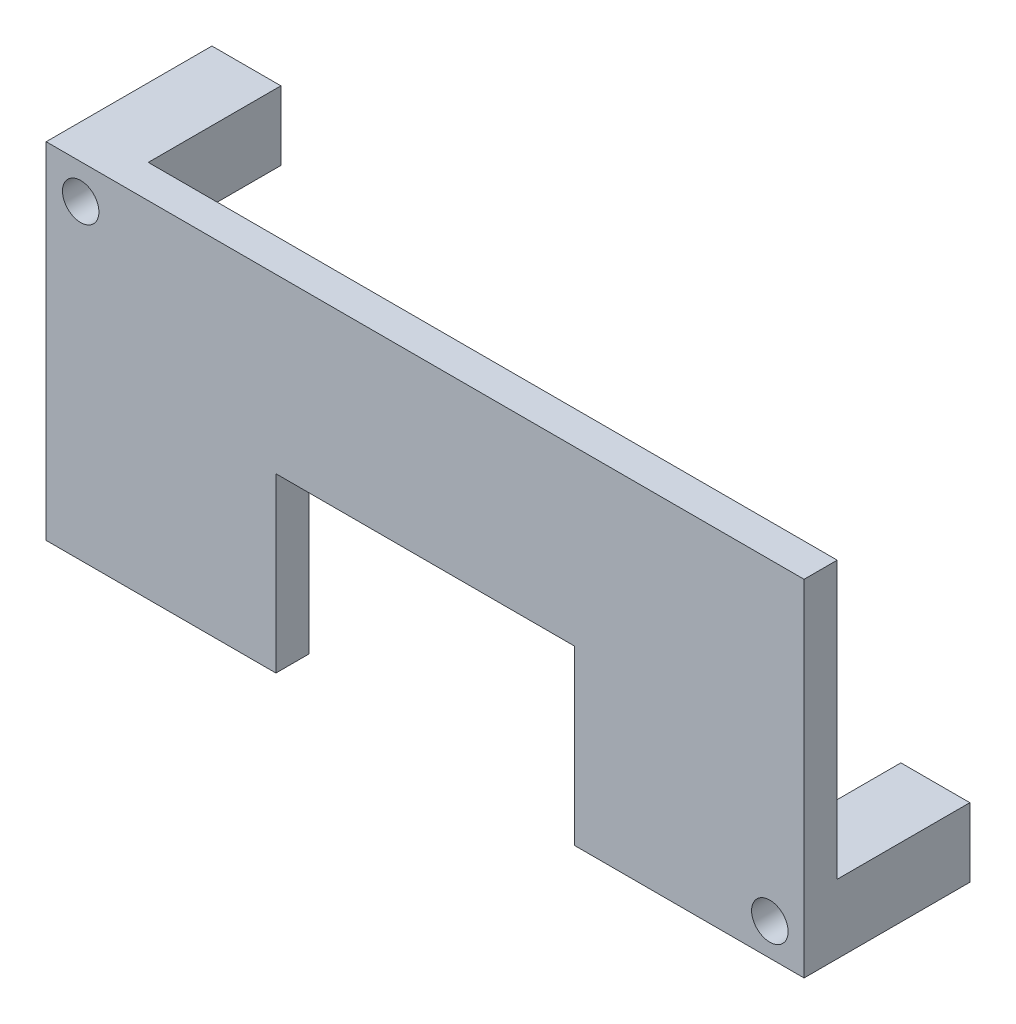
ISO-10303-21;
HEADER;
FILE_DESCRIPTION(('STEP AP214'),'2;1');
FILE_NAME('part.step','',(''),(''),'','','');
FILE_SCHEMA(('AUTOMOTIVE_DESIGN { 1 0 10303 214 1 1 1 1 }'));
ENDSEC;
DATA;
#1=APPLICATION_CONTEXT('core data for automotive mechanical design processes');
#2=APPLICATION_PROTOCOL_DEFINITION('international standard','automotive_design',2000,#1);
#3=PRODUCT_CONTEXT('',#1,'mechanical');
#4=PRODUCT('Part','Part','',(#3));
#5=PRODUCT_RELATED_PRODUCT_CATEGORY('part','',(#4));
#6=PRODUCT_DEFINITION_FORMATION('','',#4);
#7=PRODUCT_DEFINITION_CONTEXT('part definition',#1,'design');
#8=PRODUCT_DEFINITION('design','',#6,#7);
#9=PRODUCT_DEFINITION_SHAPE('','',#8);
#10=(LENGTH_UNIT() NAMED_UNIT(*) SI_UNIT(.MILLI.,.METRE.));
#11=(NAMED_UNIT(*) PLANE_ANGLE_UNIT() SI_UNIT($,.RADIAN.));
#12=(NAMED_UNIT(*) SI_UNIT($,.STERADIAN.) SOLID_ANGLE_UNIT());
#13=UNCERTAINTY_MEASURE_WITH_UNIT(LENGTH_MEASURE(1.E-05),#10,'distance_accuracy_value','');
#14=(GEOMETRIC_REPRESENTATION_CONTEXT(3) GLOBAL_UNCERTAINTY_ASSIGNED_CONTEXT((#13)) GLOBAL_UNIT_ASSIGNED_CONTEXT((#10,
#11,#12)) REPRESENTATION_CONTEXT('',''));
#15=CARTESIAN_POINT('',(0.,0.,0.));
#16=DIRECTION('',(0.,0.,1.));
#17=DIRECTION('',(1.,0.,0.));
#18=AXIS2_PLACEMENT_3D('',#15,#16,#17);
#19=CARTESIAN_POINT('',(0.,0.,0.));
#20=DIRECTION('',(0.,0.,-1.));
#21=DIRECTION('',(-1.,0.,0.));
#22=AXIS2_PLACEMENT_3D('',#19,#20,#21);
#23=PLANE('',#22);
#24=DIRECTION('',(1.,0.,0.));
#25=VECTOR('',#24,1.);
#26=CARTESIAN_POINT('',(18.7,-6.255,0.));
#27=LINE('',#26,#25);
#28=CARTESIAN_POINT('',(18.7,-6.255,0.));
#29=VERTEX_POINT('',#28);
#30=CARTESIAN_POINT('',(22.86,-6.255,0.));
#31=VERTEX_POINT('',#30);
#32=EDGE_CURVE('E165',#29,#31,#27,.T.);
#33=ORIENTED_EDGE('',*,*,#32,.F.);
#34=DIRECTION('',(0.,1.,0.));
#35=VECTOR('',#34,1.);
#36=CARTESIAN_POINT('',(18.7,-6.255,0.));
#37=LINE('',#36,#35);
#38=CARTESIAN_POINT('',(18.7,-10.415,0.));
#39=VERTEX_POINT('',#38);
#40=EDGE_CURVE('E169',#39,#29,#37,.T.);
#41=ORIENTED_EDGE('',*,*,#40,.F.);
#42=DIRECTION('',(1.,0.,0.));
#43=VECTOR('',#42,1.);
#44=CARTESIAN_POINT('',(-22.86,-10.415,0.));
#45=LINE('',#44,#43);
#46=CARTESIAN_POINT('',(9.,-10.415,0.));
#47=VERTEX_POINT('',#46);
#48=EDGE_CURVE('E253',#47,#39,#45,.T.);
#49=ORIENTED_EDGE('',*,*,#48,.F.);
#50=DIRECTION('',(0.,-1.,0.));
#51=VECTOR('',#50,1.);
#52=CARTESIAN_POINT('',(9.,0.,0.));
#53=LINE('',#52,#51);
#54=CARTESIAN_POINT('',(9.,0.,0.));
#55=VERTEX_POINT('',#54);
#56=EDGE_CURVE('E203',#55,#47,#53,.T.);
#57=ORIENTED_EDGE('',*,*,#56,.F.);
#58=DIRECTION('',(1.,0.,0.));
#59=VECTOR('',#58,1.);
#60=CARTESIAN_POINT('',(-9.,0.,0.));
#61=LINE('',#60,#59);
#62=CARTESIAN_POINT('',(-9.,0.,0.));
#63=VERTEX_POINT('',#62);
#64=EDGE_CURVE('E209',#63,#55,#61,.T.);
#65=ORIENTED_EDGE('',*,*,#64,.F.);
#66=DIRECTION('',(0.,1.,0.));
#67=VECTOR('',#66,1.);
#68=CARTESIAN_POINT('',(-9.,0.,0.));
#69=LINE('',#68,#67);
#70=CARTESIAN_POINT('',(-9.,-10.415,0.));
#71=VERTEX_POINT('',#70);
#72=EDGE_CURVE('E206',#71,#63,#69,.T.);
#73=ORIENTED_EDGE('',*,*,#72,.F.);
#74=CARTESIAN_POINT('',(-22.86,-10.415,0.));
#75=VERTEX_POINT('',#74);
#76=EDGE_CURVE('E237',#75,#71,#45,.T.);
#77=ORIENTED_EDGE('',*,*,#76,.F.);
#78=DIRECTION('',(0.,-1.,0.));
#79=VECTOR('',#78,1.);
#80=CARTESIAN_POINT('',(-22.86,-10.415,0.));
#81=LINE('',#80,#79);
#82=CARTESIAN_POINT('',(-22.86,6.255,0.));
#83=VERTEX_POINT('',#82);
#84=EDGE_CURVE('E60',#83,#75,#81,.T.);
#85=ORIENTED_EDGE('',*,*,#84,.F.);
#86=DIRECTION('',(-1.,0.,0.));
#87=VECTOR('',#86,1.);
#88=CARTESIAN_POINT('',(-22.86,6.255,0.));
#89=LINE('',#88,#87);
#90=CARTESIAN_POINT('',(-18.7,6.255,0.));
#91=VERTEX_POINT('',#90);
#92=EDGE_CURVE('E173',#91,#83,#89,.T.);
#93=ORIENTED_EDGE('',*,*,#92,.F.);
#94=DIRECTION('',(0.,-1.,0.));
#95=VECTOR('',#94,1.);
#96=CARTESIAN_POINT('',(-18.7,10.415,0.));
#97=LINE('',#96,#95);
#98=CARTESIAN_POINT('',(-18.7,10.415,0.));
#99=VERTEX_POINT('',#98);
#100=EDGE_CURVE('E54',#99,#91,#97,.T.);
#101=ORIENTED_EDGE('',*,*,#100,.F.);
#102=DIRECTION('',(-1.,0.,0.));
#103=VECTOR('',#102,1.);
#104=CARTESIAN_POINT('',(-22.86,10.415,0.));
#105=LINE('',#104,#103);
#106=CARTESIAN_POINT('',(22.86,10.415,0.));
#107=VERTEX_POINT('',#106);
#108=EDGE_CURVE('E249',#107,#99,#105,.T.);
#109=ORIENTED_EDGE('',*,*,#108,.F.);
#110=DIRECTION('',(0.,1.,0.));
#111=VECTOR('',#110,1.);
#112=CARTESIAN_POINT('',(22.86,-10.415,0.));
#113=LINE('',#112,#111);
#114=EDGE_CURVE('E232',#31,#107,#113,.T.);
#115=ORIENTED_EDGE('',*,*,#114,.F.);
#116=EDGE_LOOP('',(#33,#41,#49,#57,#65,#73,#77,#85,#93,#101,#109,#115));
#117=FACE_BOUND('',#116,.T.);
#118=ADVANCED_FACE('F39',(#117),#23,.T.);
#119=CARTESIAN_POINT('',(-22.86,-10.415,2.));
#120=DIRECTION('',(0.,1.,0.));
#121=DIRECTION('',(0.,0.,1.));
#122=AXIS2_PLACEMENT_3D('',#119,#120,#121);
#123=PLANE('',#122);
#124=DIRECTION('',(1.,0.,0.));
#125=VECTOR('',#124,1.);
#126=CARTESIAN_POINT('',(-22.86,-10.415,2.));
#127=LINE('',#126,#125);
#128=CARTESIAN_POINT('',(9.,-10.415,2.));
#129=VERTEX_POINT('',#128);
#130=CARTESIAN_POINT('',(22.86,-10.415,2.));
#131=VERTEX_POINT('',#130);
#132=EDGE_CURVE('E242',#129,#131,#127,.T.);
#133=ORIENTED_EDGE('',*,*,#132,.F.);
#134=DIRECTION('',(0.,0.,-1.));
#135=VECTOR('',#134,1.);
#136=CARTESIAN_POINT('',(9.,-10.415,10.));
#137=LINE('',#136,#135);
#138=EDGE_CURVE('E212',#129,#47,#137,.T.);
#139=ORIENTED_EDGE('',*,*,#138,.T.);
#140=ORIENTED_EDGE('',*,*,#48,.T.);
#141=DIRECTION('',(0.,0.,1.));
#142=VECTOR('',#141,1.);
#143=CARTESIAN_POINT('',(18.7,-10.415,-8.));
#144=LINE('',#143,#142);
#145=CARTESIAN_POINT('',(18.7,-10.415,-8.));
#146=VERTEX_POINT('',#145);
#147=EDGE_CURVE('E175',#146,#39,#144,.T.);
#148=ORIENTED_EDGE('',*,*,#147,.F.);
#149=DIRECTION('',(-1.,0.,0.));
#150=VECTOR('',#149,1.);
#151=CARTESIAN_POINT('',(18.7,-10.415,-8.));
#152=LINE('',#151,#150);
#153=CARTESIAN_POINT('',(22.86,-10.415,-8.));
#154=VERTEX_POINT('',#153);
#155=EDGE_CURVE('E161',#154,#146,#152,.T.);
#156=ORIENTED_EDGE('',*,*,#155,.F.);
#157=DIRECTION('',(0.,0.,-1.));
#158=VECTOR('',#157,1.);
#159=CARTESIAN_POINT('',(22.86,-10.415,2.));
#160=LINE('',#159,#158);
#161=EDGE_CURVE('E246',#131,#154,#160,.T.);
#162=ORIENTED_EDGE('',*,*,#161,.F.);
#163=EDGE_LOOP('',(#133,#139,#140,#148,#156,#162));
#164=FACE_BOUND('',#163,.T.);
#165=ADVANCED_FACE('F332',(#164),#123,.F.);
#166=CARTESIAN_POINT('',(22.86,-10.415,2.));
#167=DIRECTION('',(-1.,0.,0.));
#168=DIRECTION('',(0.,0.,1.));
#169=AXIS2_PLACEMENT_3D('',#166,#167,#168);
#170=PLANE('',#169);
#171=ORIENTED_EDGE('',*,*,#161,.T.);
#172=DIRECTION('',(0.,-1.,0.));
#173=VECTOR('',#172,1.);
#174=CARTESIAN_POINT('',(22.86,-6.255,-8.));
#175=LINE('',#174,#173);
#176=CARTESIAN_POINT('',(22.86,-6.255,-8.));
#177=VERTEX_POINT('',#176);
#178=EDGE_CURVE('E155',#177,#154,#175,.T.);
#179=ORIENTED_EDGE('',*,*,#178,.F.);
#180=DIRECTION('',(0.,0.,1.));
#181=VECTOR('',#180,1.);
#182=CARTESIAN_POINT('',(22.86,-6.255,-8.));
#183=LINE('',#182,#181);
#184=EDGE_CURVE('E151',#177,#31,#183,.T.);
#185=ORIENTED_EDGE('',*,*,#184,.T.);
#186=ORIENTED_EDGE('',*,*,#114,.T.);
#187=DIRECTION('',(0.,0.,-1.));
#188=VECTOR('',#187,1.);
#189=CARTESIAN_POINT('',(22.86,10.415,2.));
#190=LINE('',#189,#188);
#191=CARTESIAN_POINT('',(22.86,10.415,2.));
#192=VERTEX_POINT('',#191);
#193=EDGE_CURVE('E11',#192,#107,#190,.T.);
#194=ORIENTED_EDGE('',*,*,#193,.F.);
#195=DIRECTION('',(0.,1.,0.));
#196=VECTOR('',#195,1.);
#197=CARTESIAN_POINT('',(22.86,-10.415,2.));
#198=LINE('',#197,#196);
#199=EDGE_CURVE('E233',#131,#192,#198,.T.);
#200=ORIENTED_EDGE('',*,*,#199,.F.);
#201=EDGE_LOOP('',(#171,#179,#185,#186,#194,#200));
#202=FACE_BOUND('',#201,.T.);
#203=ADVANCED_FACE('F41',(#202),#170,.F.);
#204=CARTESIAN_POINT('',(-22.86,10.415,2.));
#205=DIRECTION('',(0.,-1.,0.));
#206=DIRECTION('',(0.,0.,-1.));
#207=AXIS2_PLACEMENT_3D('',#204,#205,#206);
#208=PLANE('',#207);
#209=ORIENTED_EDGE('',*,*,#108,.T.);
#210=DIRECTION('',(0.,0.,1.));
#211=VECTOR('',#210,1.);
#212=CARTESIAN_POINT('',(-18.7,10.415,-8.));
#213=LINE('',#212,#211);
#214=CARTESIAN_POINT('',(-18.7,10.415,-8.));
#215=VERTEX_POINT('',#214);
#216=EDGE_CURVE('E199',#215,#99,#213,.T.);
#217=ORIENTED_EDGE('',*,*,#216,.F.);
#218=DIRECTION('',(1.,0.,0.));
#219=VECTOR('',#218,1.);
#220=CARTESIAN_POINT('',(-22.86,10.415,-8.));
#221=LINE('',#220,#219);
#222=CARTESIAN_POINT('',(-22.86,10.415,-8.));
#223=VERTEX_POINT('',#222);
#224=EDGE_CURVE('E182',#223,#215,#221,.T.);
#225=ORIENTED_EDGE('',*,*,#224,.F.);
#226=DIRECTION('',(0.,0.,-1.));
#227=VECTOR('',#226,1.);
#228=CARTESIAN_POINT('',(-22.86,10.415,2.));
#229=LINE('',#228,#227);
#230=CARTESIAN_POINT('',(-22.86,10.415,2.));
#231=VERTEX_POINT('',#230);
#232=EDGE_CURVE('E47',#231,#223,#229,.T.);
#233=ORIENTED_EDGE('',*,*,#232,.F.);
#234=DIRECTION('',(-1.,0.,0.));
#235=VECTOR('',#234,1.);
#236=CARTESIAN_POINT('',(-22.86,10.415,2.));
#237=LINE('',#236,#235);
#238=EDGE_CURVE('E236',#192,#231,#237,.T.);
#239=ORIENTED_EDGE('',*,*,#238,.F.);
#240=ORIENTED_EDGE('',*,*,#193,.T.);
#241=EDGE_LOOP('',(#209,#217,#225,#233,#239,#240));
#242=FACE_BOUND('',#241,.T.);
#243=ADVANCED_FACE('F268',(#242),#208,.F.);
#244=CARTESIAN_POINT('',(-22.86,-10.415,2.));
#245=DIRECTION('',(1.,0.,0.));
#246=DIRECTION('',(0.,0.,-1.));
#247=AXIS2_PLACEMENT_3D('',#244,#245,#246);
#248=PLANE('',#247);
#249=ORIENTED_EDGE('',*,*,#232,.T.);
#250=DIRECTION('',(0.,1.,0.));
#251=VECTOR('',#250,1.);
#252=CARTESIAN_POINT('',(-22.86,10.415,-8.));
#253=LINE('',#252,#251);
#254=CARTESIAN_POINT('',(-22.86,6.255,-8.));
#255=VERTEX_POINT('',#254);
#256=EDGE_CURVE('E179',#255,#223,#253,.T.);
#257=ORIENTED_EDGE('',*,*,#256,.F.);
#258=DIRECTION('',(0.,0.,1.));
#259=VECTOR('',#258,1.);
#260=CARTESIAN_POINT('',(-22.86,6.255,-8.));
#261=LINE('',#260,#259);
#262=EDGE_CURVE('E189',#255,#83,#261,.T.);
#263=ORIENTED_EDGE('',*,*,#262,.T.);
#264=ORIENTED_EDGE('',*,*,#84,.T.);
#265=DIRECTION('',(0.,0.,-1.));
#266=VECTOR('',#265,1.);
#267=CARTESIAN_POINT('',(-22.86,-10.415,2.));
#268=LINE('',#267,#266);
#269=CARTESIAN_POINT('',(-22.86,-10.415,2.));
#270=VERTEX_POINT('',#269);
#271=EDGE_CURVE('E257',#270,#75,#268,.T.);
#272=ORIENTED_EDGE('',*,*,#271,.F.);
#273=DIRECTION('',(0.,-1.,0.));
#274=VECTOR('',#273,1.);
#275=CARTESIAN_POINT('',(-22.86,-10.415,2.));
#276=LINE('',#275,#274);
#277=EDGE_CURVE('E240',#231,#270,#276,.T.);
#278=ORIENTED_EDGE('',*,*,#277,.F.);
#279=EDGE_LOOP('',(#249,#257,#263,#264,#272,#278));
#280=FACE_BOUND('',#279,.T.);
#281=ADVANCED_FACE('F264',(#280),#248,.F.);
#282=ORIENTED_EDGE('',*,*,#76,.T.);
#283=DIRECTION('',(0.,0.,-1.));
#284=VECTOR('',#283,1.);
#285=CARTESIAN_POINT('',(-9.,-10.415,10.));
#286=LINE('',#285,#284);
#287=CARTESIAN_POINT('',(-9.,-10.415,2.));
#288=VERTEX_POINT('',#287);
#289=EDGE_CURVE('E218',#288,#71,#286,.T.);
#290=ORIENTED_EDGE('',*,*,#289,.F.);
#291=EDGE_CURVE('E243',#270,#288,#127,.T.);
#292=ORIENTED_EDGE('',*,*,#291,.F.);
#293=ORIENTED_EDGE('',*,*,#271,.T.);
#294=EDGE_LOOP('',(#282,#290,#292,#293));
#295=FACE_BOUND('',#294,.T.);
#296=ADVANCED_FACE('F279',(#295),#123,.F.);
#297=CARTESIAN_POINT('',(0.,0.,2.));
#298=DIRECTION('',(0.,0.,-1.));
#299=DIRECTION('',(-1.,0.,0.));
#300=AXIS2_PLACEMENT_3D('',#297,#298,#299);
#301=PLANE('',#300);
#302=CARTESIAN_POINT('',(20.7954759728349,-8.47672208066541,2.));
#303=DIRECTION('',(0.,0.,-1.));
#304=DIRECTION('',(-1.,0.,0.));
#305=AXIS2_PLACEMENT_3D('',#302,#303,#304);
#306=CIRCLE('',#305,1.09999999999999);
#307=CARTESIAN_POINT('',(19.6954759728349,-8.47672208066541,2.));
#308=VERTEX_POINT('',#307);
#309=EDGE_CURVE('E310',#308,#308,#306,.T.);
#310=ORIENTED_EDGE('',*,*,#309,.T.);
#311=EDGE_LOOP('',(#310));
#312=FACE_BOUND('',#311,.T.);
#313=CARTESIAN_POINT('',(-20.7772000000001,8.33219999999998,2.));
#314=DIRECTION('',(0.,0.,-1.));
#315=DIRECTION('',(-1.,0.,0.));
#316=AXIS2_PLACEMENT_3D('',#313,#314,#315);
#317=CIRCLE('',#316,1.09999999999999);
#318=CARTESIAN_POINT('',(-21.8772,8.33219999999998,2.));
#319=VERTEX_POINT('',#318);
#320=EDGE_CURVE('E296',#319,#319,#317,.T.);
#321=ORIENTED_EDGE('',*,*,#320,.T.);
#322=EDGE_LOOP('',(#321));
#323=FACE_BOUND('',#322,.T.);
#324=DIRECTION('',(1.,0.,0.));
#325=VECTOR('',#324,1.);
#326=CARTESIAN_POINT('',(0.,0.,2.));
#327=LINE('',#326,#325);
#328=CARTESIAN_POINT('',(-9.,0.,2.));
#329=VERTEX_POINT('',#328);
#330=CARTESIAN_POINT('',(9.,0.,2.));
#331=VERTEX_POINT('',#330);
#332=EDGE_CURVE('E225',#329,#331,#327,.T.);
#333=ORIENTED_EDGE('',*,*,#332,.T.);
#334=DIRECTION('',(0.,-1.,0.));
#335=VECTOR('',#334,1.);
#336=CARTESIAN_POINT('',(9.,0.,2.));
#337=LINE('',#336,#335);
#338=EDGE_CURVE('E228',#331,#129,#337,.T.);
#339=ORIENTED_EDGE('',*,*,#338,.T.);
#340=ORIENTED_EDGE('',*,*,#132,.T.);
#341=ORIENTED_EDGE('',*,*,#199,.T.);
#342=ORIENTED_EDGE('',*,*,#238,.T.);
#343=ORIENTED_EDGE('',*,*,#277,.T.);
#344=ORIENTED_EDGE('',*,*,#291,.T.);
#345=DIRECTION('',(0.,1.,0.));
#346=VECTOR('',#345,1.);
#347=CARTESIAN_POINT('',(-9.,0.,2.));
#348=LINE('',#347,#346);
#349=EDGE_CURVE('E215',#288,#329,#348,.T.);
#350=ORIENTED_EDGE('',*,*,#349,.T.);
#351=EDGE_LOOP('',(#333,#339,#340,#341,#342,#343,#344,#350));
#352=FACE_BOUND('',#351,.T.);
#353=ADVANCED_FACE('F288',(#312,#323,#352),#301,.F.);
#354=CARTESIAN_POINT('',(9.,0.,10.));
#355=DIRECTION('',(1.,0.,0.));
#356=DIRECTION('',(0.,1.,0.));
#357=AXIS2_PLACEMENT_3D('',#354,#355,#356);
#358=PLANE('',#357);
#359=DIRECTION('',(0.,0.,-1.));
#360=VECTOR('',#359,1.);
#361=CARTESIAN_POINT('',(9.,0.,10.));
#362=LINE('',#361,#360);
#363=EDGE_CURVE('E213',#331,#55,#362,.T.);
#364=ORIENTED_EDGE('',*,*,#363,.T.);
#365=ORIENTED_EDGE('',*,*,#56,.T.);
#366=ORIENTED_EDGE('',*,*,#138,.F.);
#367=ORIENTED_EDGE('',*,*,#338,.F.);
#368=EDGE_LOOP('',(#364,#365,#366,#367));
#369=FACE_BOUND('',#368,.T.);
#370=ADVANCED_FACE('F379',(#369),#358,.F.);
#371=CARTESIAN_POINT('',(-9.,0.,10.));
#372=DIRECTION('',(0.,1.,0.));
#373=DIRECTION('',(0.,0.,1.));
#374=AXIS2_PLACEMENT_3D('',#371,#372,#373);
#375=PLANE('',#374);
#376=DIRECTION('',(0.,0.,-1.));
#377=VECTOR('',#376,1.);
#378=CARTESIAN_POINT('',(-9.,0.,10.));
#379=LINE('',#378,#377);
#380=EDGE_CURVE('E216',#329,#63,#379,.T.);
#381=ORIENTED_EDGE('',*,*,#380,.T.);
#382=ORIENTED_EDGE('',*,*,#64,.T.);
#383=ORIENTED_EDGE('',*,*,#363,.F.);
#384=ORIENTED_EDGE('',*,*,#332,.F.);
#385=EDGE_LOOP('',(#381,#382,#383,#384));
#386=FACE_BOUND('',#385,.T.);
#387=ADVANCED_FACE('F369',(#386),#375,.F.);
#388=CARTESIAN_POINT('',(-9.,0.,10.));
#389=DIRECTION('',(-1.,0.,0.));
#390=DIRECTION('',(0.,-1.,0.));
#391=AXIS2_PLACEMENT_3D('',#388,#389,#390);
#392=PLANE('',#391);
#393=ORIENTED_EDGE('',*,*,#289,.T.);
#394=ORIENTED_EDGE('',*,*,#72,.T.);
#395=ORIENTED_EDGE('',*,*,#380,.F.);
#396=ORIENTED_EDGE('',*,*,#349,.F.);
#397=EDGE_LOOP('',(#393,#394,#395,#396));
#398=FACE_BOUND('',#397,.T.);
#399=ADVANCED_FACE('F286',(#398),#392,.F.);
#400=CARTESIAN_POINT('',(-18.7,10.415,-8.));
#401=DIRECTION('',(-1.,0.,0.));
#402=DIRECTION('',(0.,0.,1.));
#403=AXIS2_PLACEMENT_3D('',#400,#401,#402);
#404=PLANE('',#403);
#405=ORIENTED_EDGE('',*,*,#100,.T.);
#406=DIRECTION('',(0.,0.,1.));
#407=VECTOR('',#406,1.);
#408=CARTESIAN_POINT('',(-18.7,6.255,-8.));
#409=LINE('',#408,#407);
#410=CARTESIAN_POINT('',(-18.7,6.255,-8.));
#411=VERTEX_POINT('',#410);
#412=EDGE_CURVE('E195',#411,#91,#409,.T.);
#413=ORIENTED_EDGE('',*,*,#412,.F.);
#414=DIRECTION('',(0.,-1.,0.));
#415=VECTOR('',#414,1.);
#416=CARTESIAN_POINT('',(-18.7,10.415,-8.));
#417=LINE('',#416,#415);
#418=EDGE_CURVE('E185',#215,#411,#417,.T.);
#419=ORIENTED_EDGE('',*,*,#418,.F.);
#420=ORIENTED_EDGE('',*,*,#216,.T.);
#421=EDGE_LOOP('',(#405,#413,#419,#420));
#422=FACE_BOUND('',#421,.T.);
#423=ADVANCED_FACE('F368',(#422),#404,.F.);
#424=CARTESIAN_POINT('',(-22.86,6.255,-8.));
#425=DIRECTION('',(0.,1.,0.));
#426=DIRECTION('',(-1.,0.,0.));
#427=AXIS2_PLACEMENT_3D('',#424,#425,#426);
#428=PLANE('',#427);
#429=ORIENTED_EDGE('',*,*,#92,.T.);
#430=ORIENTED_EDGE('',*,*,#262,.F.);
#431=DIRECTION('',(-1.,0.,0.));
#432=VECTOR('',#431,1.);
#433=CARTESIAN_POINT('',(-22.86,6.255,-8.));
#434=LINE('',#433,#432);
#435=EDGE_CURVE('E188',#411,#255,#434,.T.);
#436=ORIENTED_EDGE('',*,*,#435,.F.);
#437=ORIENTED_EDGE('',*,*,#412,.T.);
#438=EDGE_LOOP('',(#429,#430,#436,#437));
#439=FACE_BOUND('',#438,.T.);
#440=ADVANCED_FACE('F276',(#439),#428,.F.);
#441=CARTESIAN_POINT('',(0.,0.,-8.));
#442=DIRECTION('',(0.,0.,1.));
#443=DIRECTION('',(1.,0.,0.));
#444=AXIS2_PLACEMENT_3D('',#441,#442,#443);
#445=PLANE('',#444);
#446=CARTESIAN_POINT('',(-20.7772000000001,8.33219999999998,-8.));
#447=DIRECTION('',(0.,0.,-1.));
#448=DIRECTION('',(-1.,0.,0.));
#449=AXIS2_PLACEMENT_3D('',#446,#447,#448);
#450=CIRCLE('',#449,1.09999999999999);
#451=CARTESIAN_POINT('',(-21.8772,8.33219999999998,-8.));
#452=VERTEX_POINT('',#451);
#453=EDGE_CURVE('E306',#452,#452,#450,.T.);
#454=ORIENTED_EDGE('',*,*,#453,.F.);
#455=EDGE_LOOP('',(#454));
#456=FACE_BOUND('',#455,.T.);
#457=ORIENTED_EDGE('',*,*,#256,.T.);
#458=ORIENTED_EDGE('',*,*,#224,.T.);
#459=ORIENTED_EDGE('',*,*,#418,.T.);
#460=ORIENTED_EDGE('',*,*,#435,.T.);
#461=EDGE_LOOP('',(#457,#458,#459,#460));
#462=FACE_BOUND('',#461,.T.);
#463=ADVANCED_FACE('F271',(#456,#462),#445,.F.);
#464=CARTESIAN_POINT('',(18.7,-6.255,-8.));
#465=DIRECTION('',(1.,0.,0.));
#466=DIRECTION('',(0.,0.,-1.));
#467=AXIS2_PLACEMENT_3D('',#464,#465,#466);
#468=PLANE('',#467);
#469=ORIENTED_EDGE('',*,*,#40,.T.);
#470=DIRECTION('',(0.,0.,1.));
#471=VECTOR('',#470,1.);
#472=CARTESIAN_POINT('',(18.7,-6.255,-8.));
#473=LINE('',#472,#471);
#474=CARTESIAN_POINT('',(18.7,-6.255,-8.));
#475=VERTEX_POINT('',#474);
#476=EDGE_CURVE('E148',#475,#29,#473,.T.);
#477=ORIENTED_EDGE('',*,*,#476,.F.);
#478=DIRECTION('',(0.,1.,0.));
#479=VECTOR('',#478,1.);
#480=CARTESIAN_POINT('',(18.7,-6.255,-8.));
#481=LINE('',#480,#479);
#482=EDGE_CURVE('E156',#146,#475,#481,.T.);
#483=ORIENTED_EDGE('',*,*,#482,.F.);
#484=ORIENTED_EDGE('',*,*,#147,.T.);
#485=EDGE_LOOP('',(#469,#477,#483,#484));
#486=FACE_BOUND('',#485,.T.);
#487=ADVANCED_FACE('F167',(#486),#468,.F.);
#488=CARTESIAN_POINT('',(18.7,-6.255,-8.));
#489=DIRECTION('',(0.,-1.,0.));
#490=DIRECTION('',(0.,0.,-1.));
#491=AXIS2_PLACEMENT_3D('',#488,#489,#490);
#492=PLANE('',#491);
#493=ORIENTED_EDGE('',*,*,#32,.T.);
#494=ORIENTED_EDGE('',*,*,#184,.F.);
#495=DIRECTION('',(1.,0.,0.));
#496=VECTOR('',#495,1.);
#497=CARTESIAN_POINT('',(18.7,-6.255,-8.));
#498=LINE('',#497,#496);
#499=EDGE_CURVE('E144',#475,#177,#498,.T.);
#500=ORIENTED_EDGE('',*,*,#499,.F.);
#501=ORIENTED_EDGE('',*,*,#476,.T.);
#502=EDGE_LOOP('',(#493,#494,#500,#501));
#503=FACE_BOUND('',#502,.T.);
#504=ADVANCED_FACE('F146',(#503),#492,.F.);
#505=CARTESIAN_POINT('',(0.,0.,-8.));
#506=DIRECTION('',(0.,0.,1.));
#507=DIRECTION('',(1.,0.,0.));
#508=AXIS2_PLACEMENT_3D('',#505,#506,#507);
#509=PLANE('',#508);
#510=CARTESIAN_POINT('',(20.7954759728349,-8.47672208066541,-8.));
#511=DIRECTION('',(0.,0.,-1.));
#512=DIRECTION('',(-1.,0.,0.));
#513=AXIS2_PLACEMENT_3D('',#510,#511,#512);
#514=CIRCLE('',#513,1.1);
#515=CARTESIAN_POINT('',(19.6954759728349,-8.47672208066541,-8.));
#516=VERTEX_POINT('',#515);
#517=EDGE_CURVE('E313',#516,#516,#514,.T.);
#518=ORIENTED_EDGE('',*,*,#517,.F.);
#519=EDGE_LOOP('',(#518));
#520=FACE_BOUND('',#519,.T.);
#521=ORIENTED_EDGE('',*,*,#482,.T.);
#522=ORIENTED_EDGE('',*,*,#499,.T.);
#523=ORIENTED_EDGE('',*,*,#178,.T.);
#524=ORIENTED_EDGE('',*,*,#155,.T.);
#525=EDGE_LOOP('',(#521,#522,#523,#524));
#526=FACE_BOUND('',#525,.T.);
#527=ADVANCED_FACE('F159',(#520,#526),#509,.F.);
#528=CARTESIAN_POINT('',(-20.7772000000001,8.33219999999998,-8.));
#529=DIRECTION('',(0.,0.,-1.));
#530=DIRECTION('',(-1.,0.,0.));
#531=AXIS2_PLACEMENT_3D('',#528,#529,#530);
#532=CYLINDRICAL_SURFACE('',#531,1.09999999999999);
#533=ORIENTED_EDGE('',*,*,#320,.F.);
#534=EDGE_LOOP('',(#533));
#535=FACE_BOUND('',#534,.T.);
#536=ORIENTED_EDGE('',*,*,#453,.T.);
#537=EDGE_LOOP('',(#536));
#538=FACE_BOUND('',#537,.T.);
#539=ADVANCED_FACE('F320',(#535,#538),#532,.F.);
#540=CARTESIAN_POINT('',(20.7954759728349,-8.47672208066541,-8.));
#541=DIRECTION('',(0.,0.,-1.));
#542=DIRECTION('',(-1.,0.,0.));
#543=AXIS2_PLACEMENT_3D('',#540,#541,#542);
#544=CYLINDRICAL_SURFACE('',#543,1.09999999999999);
#545=ORIENTED_EDGE('',*,*,#309,.F.);
#546=EDGE_LOOP('',(#545));
#547=FACE_BOUND('',#546,.T.);
#548=ORIENTED_EDGE('',*,*,#517,.T.);
#549=EDGE_LOOP('',(#548));
#550=FACE_BOUND('',#549,.T.);
#551=ADVANCED_FACE('F317',(#547,#550),#544,.F.);
#552=CLOSED_SHELL('',(#118,#165,#203,#243,#281,#296,#353,#370,#387,#399,#423,#440,#463,#487,
#504,#527,#539,#551));
#553=MANIFOLD_SOLID_BREP('B2',#552);
#554=ADVANCED_BREP_SHAPE_REPRESENTATION('',(#18,#553),#14);
#555=SHAPE_DEFINITION_REPRESENTATION(#9,#554);
ENDSEC;
END-ISO-10303-21;
